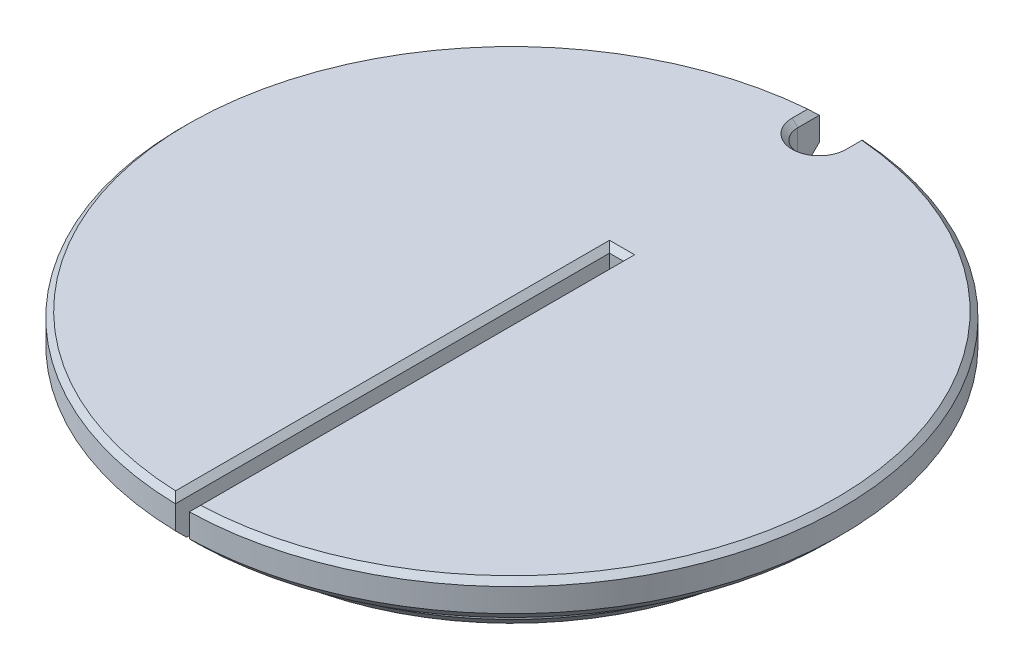
ISO-10303-21;
HEADER;
FILE_DESCRIPTION(('STEP AP214'),'2;1');
FILE_NAME('part.step','',(''),(''),'','','');
FILE_SCHEMA(('AUTOMOTIVE_DESIGN { 1 0 10303 214 1 1 1 1 }'));
ENDSEC;
DATA;
#1=APPLICATION_CONTEXT('core data for automotive mechanical design processes');
#2=APPLICATION_PROTOCOL_DEFINITION('international standard','automotive_design',2000,#1);
#3=PRODUCT_CONTEXT('',#1,'mechanical');
#4=PRODUCT('Part','Part','',(#3));
#5=PRODUCT_RELATED_PRODUCT_CATEGORY('part','',(#4));
#6=PRODUCT_DEFINITION_FORMATION('','',#4);
#7=PRODUCT_DEFINITION_CONTEXT('part definition',#1,'design');
#8=PRODUCT_DEFINITION('design','',#6,#7);
#9=PRODUCT_DEFINITION_SHAPE('','',#8);
#10=(LENGTH_UNIT() NAMED_UNIT(*) SI_UNIT(.MILLI.,.METRE.));
#11=(NAMED_UNIT(*) PLANE_ANGLE_UNIT() SI_UNIT($,.RADIAN.));
#12=(NAMED_UNIT(*) SI_UNIT($,.STERADIAN.) SOLID_ANGLE_UNIT());
#13=UNCERTAINTY_MEASURE_WITH_UNIT(LENGTH_MEASURE(1.E-05),#10,'distance_accuracy_value','');
#14=(GEOMETRIC_REPRESENTATION_CONTEXT(3) GLOBAL_UNCERTAINTY_ASSIGNED_CONTEXT((#13)) GLOBAL_UNIT_ASSIGNED_CONTEXT((#10,
#11,#12)) REPRESENTATION_CONTEXT('',''));
#15=CARTESIAN_POINT('',(0.,0.,0.));
#16=DIRECTION('',(0.,0.,1.));
#17=DIRECTION('',(1.,0.,0.));
#18=AXIS2_PLACEMENT_3D('',#15,#16,#17);
#19=CARTESIAN_POINT('',(3.49148133884313E-12,-1000.,0.));
#20=DIRECTION('',(0.,-1.,0.));
#21=DIRECTION('',(1.,0.,0.));
#22=AXIS2_PLACEMENT_3D('',#19,#20,#21);
#23=CYLINDRICAL_SURFACE('',#22,30.0228);
#24=DIRECTION('',(0.,-1.,0.));
#25=VECTOR('',#24,1.);
#26=CARTESIAN_POINT('',(1.95580000000349,-1000.,-29.9590281250911));
#27=LINE('',#26,#25);
#28=CARTESIAN_POINT('',(1.9558,-0.507999999999953,-29.9590281250911));
#29=VERTEX_POINT('',#28);
#30=CARTESIAN_POINT('',(1.95580000000001,-2.64160000000013,-29.9590281250911));
#31=VERTEX_POINT('',#30);
#32=EDGE_CURVE('E171',#29,#31,#27,.T.);
#33=ORIENTED_EDGE('',*,*,#32,.F.);
#34=CARTESIAN_POINT('',(0.,-0.507999999999842,0.));
#35=DIRECTION('',(0.,1.,0.));
#36=DIRECTION('',(-1.,0.,0.));
#37=AXIS2_PLACEMENT_3D('',#34,#35,#36);
#38=CIRCLE('',#37,30.0228);
#39=CARTESIAN_POINT('',(0.634999999999997,-0.507999999999842,30.0160839357835));
#40=VERTEX_POINT('',#39);
#41=EDGE_CURVE('E307',#29,#40,#38,.F.);
#42=ORIENTED_EDGE('',*,*,#41,.T.);
#43=DIRECTION('',(0.,-1.,0.));
#44=VECTOR('',#43,1.);
#45=CARTESIAN_POINT('',(0.635000000003487,-1000.,30.0160839357835));
#46=LINE('',#45,#44);
#47=CARTESIAN_POINT('',(0.635000000000004,-2.64160000000013,30.0160839357835));
#48=VERTEX_POINT('',#47);
#49=EDGE_CURVE('E216',#48,#40,#46,.F.);
#50=ORIENTED_EDGE('',*,*,#49,.F.);
#51=CARTESIAN_POINT('',(0.,-2.64160000000013,0.));
#52=DIRECTION('',(0.,-1.,0.));
#53=DIRECTION('',(1.,0.,0.));
#54=AXIS2_PLACEMENT_3D('',#51,#52,#53);
#55=CIRCLE('',#54,30.0228);
#56=EDGE_CURVE('E304',#48,#31,#55,.F.);
#57=ORIENTED_EDGE('',*,*,#56,.T.);
#58=EDGE_LOOP('',(#33,#42,#50,#57));
#59=FACE_BOUND('',#58,.T.);
#60=ADVANCED_FACE('F34',(#59),#23,.T.);
#61=CARTESIAN_POINT('',(30.0228,0.,0.));
#62=DIRECTION('',(0.,1.,0.));
#63=DIRECTION('',(-1.,0.,0.));
#64=AXIS2_PLACEMENT_3D('',#61,#62,#63);
#65=PLANE('',#64);
#66=CARTESIAN_POINT('',(0.,0.,0.));
#67=DIRECTION('',(0.,1.,0.));
#68=DIRECTION('',(-1.,0.,0.));
#69=AXIS2_PLACEMENT_3D('',#66,#67,#68);
#70=CIRCLE('',#69,29.5148000000001);
#71=CARTESIAN_POINT('',(1.14299999999981,0.,29.4926595959064));
#72=VERTEX_POINT('',#71);
#73=CARTESIAN_POINT('',(2.46379999999981,0.,-29.4117851991342));
#74=VERTEX_POINT('',#73);
#75=EDGE_CURVE('E425',#72,#74,#70,.T.);
#76=ORIENTED_EDGE('',*,*,#75,.T.);
#77=DIRECTION('',(0.,0.,1.));
#78=VECTOR('',#77,1.);
#79=CARTESIAN_POINT('',(2.46379999999981,0.,-27.9908));
#80=LINE('',#79,#78);
#81=CARTESIAN_POINT('',(2.46379999999981,0.,-27.9908));
#82=VERTEX_POINT('',#81);
#83=EDGE_CURVE('E370',#74,#82,#80,.T.);
#84=ORIENTED_EDGE('',*,*,#83,.T.);
#85=CARTESIAN_POINT('',(0.,0.,-27.9908));
#86=DIRECTION('',(0.,1.,0.));
#87=DIRECTION('',(-1.,0.,0.));
#88=AXIS2_PLACEMENT_3D('',#85,#86,#87);
#89=CIRCLE('',#88,2.46379999999981);
#90=CARTESIAN_POINT('',(-2.46379999999981,0.,-27.9908));
#91=VERTEX_POINT('',#90);
#92=EDGE_CURVE('E432',#82,#91,#89,.F.);
#93=ORIENTED_EDGE('',*,*,#92,.T.);
#94=DIRECTION('',(0.,0.,-1.));
#95=VECTOR('',#94,1.);
#96=CARTESIAN_POINT('',(-2.46379999999981,0.,-29.9590281250911));
#97=LINE('',#96,#95);
#98=CARTESIAN_POINT('',(-2.46379999999981,0.,-29.4117851991342));
#99=VERTEX_POINT('',#98);
#100=EDGE_CURVE('E430',#91,#99,#97,.T.);
#101=ORIENTED_EDGE('',*,*,#100,.T.);
#102=CARTESIAN_POINT('',(0.,0.,0.));
#103=DIRECTION('',(0.,1.,0.));
#104=DIRECTION('',(-1.,0.,0.));
#105=AXIS2_PLACEMENT_3D('',#102,#103,#104);
#106=CIRCLE('',#105,29.5148000000001);
#107=CARTESIAN_POINT('',(-1.14299999999981,0.,29.4926595959064));
#108=VERTEX_POINT('',#107);
#109=EDGE_CURVE('E357',#99,#108,#106,.T.);
#110=ORIENTED_EDGE('',*,*,#109,.T.);
#111=DIRECTION('',(0.,0.,-1.));
#112=VECTOR('',#111,1.);
#113=CARTESIAN_POINT('',(-1.14299999999982,0.,-9.52500000000001));
#114=LINE('',#113,#112);
#115=CARTESIAN_POINT('',(-1.14299999999982,0.,-10.0329999999998));
#116=VERTEX_POINT('',#115);
#117=EDGE_CURVE('E349',#108,#116,#114,.T.);
#118=ORIENTED_EDGE('',*,*,#117,.T.);
#119=DIRECTION('',(1.,0.,0.));
#120=VECTOR('',#119,1.);
#121=CARTESIAN_POINT('',(0.635,0.,-10.0329999999998));
#122=LINE('',#121,#120);
#123=CARTESIAN_POINT('',(1.14299999999981,0.,-10.0329999999998));
#124=VERTEX_POINT('',#123);
#125=EDGE_CURVE('E421',#116,#124,#122,.T.);
#126=ORIENTED_EDGE('',*,*,#125,.T.);
#127=DIRECTION('',(0.,0.,1.));
#128=VECTOR('',#127,1.);
#129=CARTESIAN_POINT('',(1.14299999999981,0.,30.0160839357835));
#130=LINE('',#129,#128);
#131=EDGE_CURVE('E423',#124,#72,#130,.T.);
#132=ORIENTED_EDGE('',*,*,#131,.T.);
#133=EDGE_LOOP('',(#76,#84,#93,#101,#110,#118,#126,#132));
#134=FACE_BOUND('',#133,.T.);
#135=ADVANCED_FACE('F323',(#134),#65,.T.);
#136=CARTESIAN_POINT('',(0.,-7.62000000000004,0.));
#137=DIRECTION('',(0.,-1.,0.));
#138=DIRECTION('',(1.,0.,0.));
#139=AXIS2_PLACEMENT_3D('',#136,#137,#138);
#140=PLANE('',#139);
#141=DIRECTION('',(0.,0.,1.));
#142=VECTOR('',#141,1.);
#143=CARTESIAN_POINT('',(-0.634999999999973,-7.62000000000011,-9.52500000000001));
#144=LINE('',#143,#142);
#145=CARTESIAN_POINT('',(-0.634999999999973,-7.62000000000011,-9.52500000000001));
#146=VERTEX_POINT('',#145);
#147=CARTESIAN_POINT('',(-0.634999999999969,-7.62000000000011,24.0454168073668));
#148=VERTEX_POINT('',#147);
#149=EDGE_CURVE('E188',#146,#148,#144,.T.);
#150=ORIENTED_EDGE('',*,*,#149,.T.);
#151=CARTESIAN_POINT('',(0.,-7.62000000000004,0.));
#152=DIRECTION('',(0.,-1.,0.));
#153=DIRECTION('',(1.,0.,0.));
#154=AXIS2_PLACEMENT_3D('',#151,#152,#153);
#155=CIRCLE('',#154,24.0538);
#156=CARTESIAN_POINT('',(0.635000000000022,-7.6200000000001,24.0454168073668));
#157=VERTEX_POINT('',#156);
#158=EDGE_CURVE('E290',#148,#157,#155,.T.);
#159=ORIENTED_EDGE('',*,*,#158,.T.);
#160=DIRECTION('',(0.,0.,-1.));
#161=VECTOR('',#160,1.);
#162=CARTESIAN_POINT('',(0.635000000000027,-7.6200000000001,-9.52500000000001));
#163=LINE('',#162,#161);
#164=CARTESIAN_POINT('',(0.635000000000027,-7.6200000000001,-9.52500000000001));
#165=VERTEX_POINT('',#164);
#166=EDGE_CURVE('E194',#157,#165,#163,.T.);
#167=ORIENTED_EDGE('',*,*,#166,.T.);
#168=DIRECTION('',(-1.,0.,0.));
#169=VECTOR('',#168,1.);
#170=CARTESIAN_POINT('',(-0.634999999999973,-7.62000000000011,-9.52500000000001));
#171=LINE('',#170,#169);
#172=EDGE_CURVE('E196',#165,#146,#171,.T.);
#173=ORIENTED_EDGE('',*,*,#172,.T.);
#174=EDGE_LOOP('',(#150,#159,#167,#173));
#175=FACE_BOUND('',#174,.T.);
#176=ADVANCED_FACE('F328',(#175),#140,.T.);
#177=CARTESIAN_POINT('',(3.49148133884313E-12,-1000.,0.));
#178=DIRECTION('',(0.,-1.,0.));
#179=DIRECTION('',(1.,0.,0.));
#180=AXIS2_PLACEMENT_3D('',#177,#178,#179);
#181=CYLINDRICAL_SURFACE('',#180,25.0698);
#182=DIRECTION('',(0.,-1.,0.));
#183=VECTOR('',#182,1.);
#184=CARTESIAN_POINT('',(0.635000000003487,-1000.,25.0617566630913));
#185=LINE('',#184,#183);
#186=CARTESIAN_POINT('',(0.635000000000019,-6.60400000000005,25.0617566630913));
#187=VERTEX_POINT('',#186);
#188=CARTESIAN_POINT('',(0.635000000000011,-3.65760000000015,25.0617566630913));
#189=VERTEX_POINT('',#188);
#190=EDGE_CURVE('E206',#187,#189,#185,.F.);
#191=ORIENTED_EDGE('',*,*,#190,.F.);
#192=CARTESIAN_POINT('',(0.,-6.60400000000005,0.));
#193=DIRECTION('',(0.,-1.,0.));
#194=DIRECTION('',(1.,0.,0.));
#195=AXIS2_PLACEMENT_3D('',#192,#193,#194);
#196=CIRCLE('',#195,25.0698);
#197=CARTESIAN_POINT('',(-0.634999999999973,-6.60400000000006,25.0617566630913));
#198=VERTEX_POINT('',#197);
#199=EDGE_CURVE('E271',#187,#198,#196,.F.);
#200=ORIENTED_EDGE('',*,*,#199,.T.);
#201=DIRECTION('',(0.,-1.,0.));
#202=VECTOR('',#201,1.);
#203=CARTESIAN_POINT('',(-0.634999999996504,-1000.,25.0617566630913));
#204=LINE('',#203,#202);
#205=CARTESIAN_POINT('',(-0.634999999999983,-3.65760000000015,25.0617566630913));
#206=VERTEX_POINT('',#205);
#207=EDGE_CURVE('E210',#206,#198,#204,.T.);
#208=ORIENTED_EDGE('',*,*,#207,.F.);
#209=CARTESIAN_POINT('',(0.,-3.65760000000015,0.));
#210=DIRECTION('',(0.,-1.,0.));
#211=DIRECTION('',(1.,0.,0.));
#212=AXIS2_PLACEMENT_3D('',#209,#210,#211);
#213=CIRCLE('',#212,25.0698);
#214=EDGE_CURVE('E213',#206,#189,#213,.T.);
#215=ORIENTED_EDGE('',*,*,#214,.T.);
#216=EDGE_LOOP('',(#191,#200,#208,#215));
#217=FACE_BOUND('',#216,.T.);
#218=ADVANCED_FACE('F337',(#217),#181,.T.);
#219=CARTESIAN_POINT('',(25.0698,-3.65760000000001,0.));
#220=DIRECTION('',(0.,-1.,0.));
#221=DIRECTION('',(1.,0.,0.));
#222=AXIS2_PLACEMENT_3D('',#219,#220,#221);
#223=PLANE('',#222);
#224=DIRECTION('',(0.,0.,-1.));
#225=VECTOR('',#224,1.);
#226=CARTESIAN_POINT('',(-0.634999999999986,-3.6576000000001,0.));
#227=LINE('',#226,#225);
#228=CARTESIAN_POINT('',(-0.634999999999983,-3.6576000000001,28.9998486416742));
#229=VERTEX_POINT('',#228);
#230=EDGE_CURVE('E208',#229,#206,#227,.T.);
#231=ORIENTED_EDGE('',*,*,#230,.F.);
#232=CARTESIAN_POINT('',(0.,-3.6576000000001,0.));
#233=DIRECTION('',(0.,-1.,0.));
#234=DIRECTION('',(1.,0.,0.));
#235=AXIS2_PLACEMENT_3D('',#232,#233,#234);
#236=CIRCLE('',#235,29.0068000000002);
#237=CARTESIAN_POINT('',(-1.95579999999999,-3.6576000000001,-28.9407894259989));
#238=VERTEX_POINT('',#237);
#239=EDGE_CURVE('E185',#229,#238,#236,.T.);
#240=ORIENTED_EDGE('',*,*,#239,.T.);
#241=DIRECTION('',(0.,0.,-1.));
#242=VECTOR('',#241,1.);
#243=CARTESIAN_POINT('',(-1.95579999999999,-3.6576000000001,0.));
#244=LINE('',#243,#242);
#245=CARTESIAN_POINT('',(-1.95579999999999,-3.6576000000001,-27.9908));
#246=VERTEX_POINT('',#245);
#247=EDGE_CURVE('E177',#246,#238,#244,.T.);
#248=ORIENTED_EDGE('',*,*,#247,.F.);
#249=CARTESIAN_POINT('',(0.,-3.6576000000001,-27.9908));
#250=DIRECTION('',(0.,-1.,0.));
#251=DIRECTION('',(1.,0.,0.));
#252=AXIS2_PLACEMENT_3D('',#249,#250,#251);
#253=CIRCLE('',#252,1.9558);
#254=CARTESIAN_POINT('',(1.95580000000001,-3.65760000000009,-27.9908));
#255=VERTEX_POINT('',#254);
#256=EDGE_CURVE('E160',#255,#246,#253,.T.);
#257=ORIENTED_EDGE('',*,*,#256,.F.);
#258=DIRECTION('',(0.,0.,1.));
#259=VECTOR('',#258,1.);
#260=CARTESIAN_POINT('',(1.95580000000001,-3.65760000000009,0.));
#261=LINE('',#260,#259);
#262=CARTESIAN_POINT('',(1.95580000000001,-3.65760000000009,-28.9407894259988));
#263=VERTEX_POINT('',#262);
#264=EDGE_CURVE('E186',#263,#255,#261,.T.);
#265=ORIENTED_EDGE('',*,*,#264,.F.);
#266=CARTESIAN_POINT('',(0.,-3.6576000000001,0.));
#267=DIRECTION('',(0.,-1.,0.));
#268=DIRECTION('',(1.,0.,0.));
#269=AXIS2_PLACEMENT_3D('',#266,#267,#268);
#270=CIRCLE('',#269,29.0068);
#271=CARTESIAN_POINT('',(0.63500000000001,-3.65760000000009,28.999848641674));
#272=VERTEX_POINT('',#271);
#273=EDGE_CURVE('E170',#263,#272,#270,.T.);
#274=ORIENTED_EDGE('',*,*,#273,.T.);
#275=DIRECTION('',(0.,0.,1.));
#276=VECTOR('',#275,1.);
#277=CARTESIAN_POINT('',(0.635000000000014,-3.65760000000009,0.));
#278=LINE('',#277,#276);
#279=EDGE_CURVE('E202',#189,#272,#278,.T.);
#280=ORIENTED_EDGE('',*,*,#279,.F.);
#281=ORIENTED_EDGE('',*,*,#214,.F.);
#282=EDGE_LOOP('',(#231,#240,#248,#257,#265,#274,#280,#281));
#283=FACE_BOUND('',#282,.T.);
#284=ADVANCED_FACE('F183',(#283),#223,.T.);
#285=DIRECTION('',(0.,-1.,0.));
#286=VECTOR('',#285,1.);
#287=CARTESIAN_POINT('',(-0.634999999996504,-1000.,30.0160839357835));
#288=LINE('',#287,#286);
#289=CARTESIAN_POINT('',(-0.634999999999993,-0.507999999999953,30.0160839357835));
#290=VERTEX_POINT('',#289);
#291=CARTESIAN_POINT('',(-0.634999999999986,-2.64160000000025,30.0160839357835));
#292=VERTEX_POINT('',#291);
#293=EDGE_CURVE('E219',#290,#292,#288,.T.);
#294=ORIENTED_EDGE('',*,*,#293,.F.);
#295=CARTESIAN_POINT('',(0.,-0.507999999999842,0.));
#296=DIRECTION('',(0.,1.,0.));
#297=DIRECTION('',(-1.,0.,0.));
#298=AXIS2_PLACEMENT_3D('',#295,#296,#297);
#299=CIRCLE('',#298,30.0228);
#300=CARTESIAN_POINT('',(-1.9558,-0.507999999999953,-29.9590281250911));
#301=VERTEX_POINT('',#300);
#302=EDGE_CURVE('E11',#290,#301,#299,.F.);
#303=ORIENTED_EDGE('',*,*,#302,.T.);
#304=DIRECTION('',(0.,-1.,0.));
#305=VECTOR('',#304,1.);
#306=CARTESIAN_POINT('',(-1.95579999999651,-1000.,-29.9590281250911));
#307=LINE('',#306,#305);
#308=CARTESIAN_POINT('',(-1.95579999999999,-2.64160000000024,-29.9590281250911));
#309=VERTEX_POINT('',#308);
#310=EDGE_CURVE('E221',#309,#301,#307,.F.);
#311=ORIENTED_EDGE('',*,*,#310,.F.);
#312=CARTESIAN_POINT('',(0.,-2.64160000000024,0.));
#313=DIRECTION('',(0.,-1.,0.));
#314=DIRECTION('',(1.,0.,0.));
#315=AXIS2_PLACEMENT_3D('',#312,#313,#314);
#316=CIRCLE('',#315,30.0228);
#317=EDGE_CURVE('E234',#309,#292,#316,.F.);
#318=ORIENTED_EDGE('',*,*,#317,.T.);
#319=EDGE_LOOP('',(#294,#303,#311,#318));
#320=FACE_BOUND('',#319,.T.);
#321=ADVANCED_FACE('F324',(#320),#23,.T.);
#322=CARTESIAN_POINT('',(-0.634999999999973,-7.62000000000011,-9.52500000000001));
#323=DIRECTION('',(-1.,0.,0.));
#324=DIRECTION('',(0.,-1.,0.));
#325=AXIS2_PLACEMENT_3D('',#322,#323,#324);
#326=PLANE('',#325);
#327=DIRECTION('',(0.,1.,0.));
#328=VECTOR('',#327,1.);
#329=CARTESIAN_POINT('',(-0.634999999999973,-7.62000000000011,-9.52500000000001));
#330=LINE('',#329,#328);
#331=CARTESIAN_POINT('',(-0.634999999999998,-0.507999999999857,-9.52500000000001));
#332=VERTEX_POINT('',#331);
#333=EDGE_CURVE('E200',#146,#332,#330,.T.);
#334=ORIENTED_EDGE('',*,*,#333,.T.);
#335=DIRECTION('',(0.,0.,1.));
#336=VECTOR('',#335,1.);
#337=CARTESIAN_POINT('',(-0.634999999999993,-0.507999999999856,30.0160839357835));
#338=LINE('',#337,#336);
#339=EDGE_CURVE('E48',#332,#290,#338,.T.);
#340=ORIENTED_EDGE('',*,*,#339,.T.);
#341=ORIENTED_EDGE('',*,*,#293,.T.);
#342=CARTESIAN_POINT('',(-0.634999999999986,-2.64160000000025,30.0160839357835));
#343=CARTESIAN_POINT('',(-0.634999999999985,-2.81093400853678,29.8467120618122));
#344=CARTESIAN_POINT('',(-0.634999999999985,-2.98026767947169,29.6773398503174));
#345=CARTESIAN_POINT('',(-0.634999999999984,-3.31893434613831,29.338594752281));
#346=CARTESIAN_POINT('',(-0.634999999999983,-3.48826734187001,29.1692218657393));
#347=CARTESIAN_POINT('',(-0.634999999999983,-3.6576000000001,28.9998486416742));
#348=B_SPLINE_CURVE_WITH_KNOTS('',3,(#342,#343,#344,#345,#346,#347),.UNSPECIFIED.,.F.,.F.,(4,2,
4),(0.,0.71850368353285,1.4370073670658),.UNSPECIFIED.);
#349=EDGE_CURVE('E286',#292,#229,#348,.T.);
#350=ORIENTED_EDGE('',*,*,#349,.T.);
#351=ORIENTED_EDGE('',*,*,#230,.T.);
#352=ORIENTED_EDGE('',*,*,#207,.T.);
#353=CARTESIAN_POINT('',(-0.634999999999973,-6.60400000000006,25.0617566630913));
#354=CARTESIAN_POINT('',(-0.634999999999972,-6.77333450543348,24.8923678588454));
#355=CARTESIAN_POINT('',(-0.634999999999972,-6.94266842481684,24.7229784687455));
#356=CARTESIAN_POINT('',(-0.634999999999971,-7.2813350914835,24.3841985168374));
#357=CARTESIAN_POINT('',(-0.63499999999997,-7.45066783876681,24.2148079550292));
#358=CARTESIAN_POINT('',(-0.634999999999969,-7.62000000000005,24.0454168073668));
#359=B_SPLINE_CURVE_WITH_KNOTS('',3,(#353,#354,#355,#356,#357,#358),.UNSPECIFIED.,.F.,.F.,(4,2,
4),(0.,0.718540656879898,1.43708131376016),.UNSPECIFIED.);
#360=EDGE_CURVE('E281',#198,#148,#359,.T.);
#361=ORIENTED_EDGE('',*,*,#360,.T.);
#362=ORIENTED_EDGE('',*,*,#149,.F.);
#363=EDGE_LOOP('',(#334,#340,#341,#350,#351,#352,#361,#362));
#364=FACE_BOUND('',#363,.T.);
#365=ADVANCED_FACE('F249',(#364),#326,.F.);
#366=CARTESIAN_POINT('',(-0.634999999999973,-7.62000000000011,-9.52500000000001));
#367=DIRECTION('',(0.,0.,-1.));
#368=DIRECTION('',(-1.,0.,0.));
#369=AXIS2_PLACEMENT_3D('',#366,#367,#368);
#370=PLANE('',#369);
#371=DIRECTION('',(0.,1.,0.));
#372=VECTOR('',#371,1.);
#373=CARTESIAN_POINT('',(0.635000000000027,-7.6200000000001,-9.52500000000001));
#374=LINE('',#373,#372);
#375=CARTESIAN_POINT('',(0.635000000000002,-0.507999999999851,-9.52500000000001));
#376=VERTEX_POINT('',#375);
#377=EDGE_CURVE('E199',#165,#376,#374,.T.);
#378=ORIENTED_EDGE('',*,*,#377,.T.);
#379=DIRECTION('',(-1.,0.,0.));
#380=VECTOR('',#379,1.);
#381=CARTESIAN_POINT('',(-0.634999999999998,-0.507999999999856,-9.52500000000001));
#382=LINE('',#381,#380);
#383=EDGE_CURVE('E63',#376,#332,#382,.T.);
#384=ORIENTED_EDGE('',*,*,#383,.T.);
#385=ORIENTED_EDGE('',*,*,#333,.F.);
#386=ORIENTED_EDGE('',*,*,#172,.F.);
#387=EDGE_LOOP('',(#378,#384,#385,#386));
#388=FACE_BOUND('',#387,.T.);
#389=ADVANCED_FACE('F245',(#388),#370,.F.);
#390=CARTESIAN_POINT('',(0.635000000000027,-7.6200000000001,-9.52500000000001));
#391=DIRECTION('',(1.,0.,0.));
#392=DIRECTION('',(0.,1.,0.));
#393=AXIS2_PLACEMENT_3D('',#390,#391,#392);
#394=PLANE('',#393);
#395=ORIENTED_EDGE('',*,*,#49,.T.);
#396=DIRECTION('',(0.,0.,-1.));
#397=VECTOR('',#396,1.);
#398=CARTESIAN_POINT('',(0.635000000000002,-0.507999999999851,-9.52500000000001));
#399=LINE('',#398,#397);
#400=EDGE_CURVE('E368',#40,#376,#399,.T.);
#401=ORIENTED_EDGE('',*,*,#400,.T.);
#402=ORIENTED_EDGE('',*,*,#377,.F.);
#403=ORIENTED_EDGE('',*,*,#166,.F.);
#404=CARTESIAN_POINT('',(0.635000000000022,-7.62000000000004,24.0454168073668));
#405=CARTESIAN_POINT('',(0.635000000000022,-7.4506678387668,24.2148079550292));
#406=CARTESIAN_POINT('',(0.635000000000021,-7.2813350914835,24.3841985168374));
#407=CARTESIAN_POINT('',(0.63500000000002,-6.94266842481683,24.7229784687455));
#408=CARTESIAN_POINT('',(0.635000000000019,-6.77333450543348,24.8923678588454));
#409=CARTESIAN_POINT('',(0.635000000000019,-6.60400000000005,25.0617566630913));
#410=B_SPLINE_CURVE_WITH_KNOTS('',3,(#404,#405,#406,#407,#408,#409),.UNSPECIFIED.,.F.,.F.,(4,2,
4),(0.,0.718540656880257,1.43708131376016),.UNSPECIFIED.);
#411=EDGE_CURVE('E266',#157,#187,#410,.T.);
#412=ORIENTED_EDGE('',*,*,#411,.T.);
#413=ORIENTED_EDGE('',*,*,#190,.T.);
#414=ORIENTED_EDGE('',*,*,#279,.T.);
#415=CARTESIAN_POINT('',(0.63500000000001,-3.65760000000009,28.999848641674));
#416=CARTESIAN_POINT('',(0.635000000000009,-3.48826734186999,29.1692218657392));
#417=CARTESIAN_POINT('',(0.635000000000007,-3.31893434613826,29.3385947522809));
#418=CARTESIAN_POINT('',(0.635000000000005,-2.98026767947161,29.6773398503174));
#419=CARTESIAN_POINT('',(0.635000000000005,-2.81093400853668,29.8467120618121));
#420=CARTESIAN_POINT('',(0.635000000000004,-2.64160000000013,30.0160839357835));
#421=B_SPLINE_CURVE_WITH_KNOTS('',3,(#415,#416,#417,#418,#419,#420),.UNSPECIFIED.,.F.,.F.,(4,2,
4),(0.,0.718503683533045,1.43700736706599),.UNSPECIFIED.);
#422=EDGE_CURVE('E259',#272,#48,#421,.T.);
#423=ORIENTED_EDGE('',*,*,#422,.T.);
#424=EDGE_LOOP('',(#395,#401,#402,#403,#412,#413,#414,#423));
#425=FACE_BOUND('',#424,.T.);
#426=ADVANCED_FACE('F248',(#425),#394,.F.);
#427=CARTESIAN_POINT('',(1.95580000000003,-7.6200000000002,-29.9590281250911));
#428=DIRECTION('',(1.,0.,0.));
#429=DIRECTION('',(0.,1.,0.));
#430=AXIS2_PLACEMENT_3D('',#427,#428,#429);
#431=PLANE('',#430);
#432=DIRECTION('',(0.,1.,0.));
#433=VECTOR('',#432,1.);
#434=CARTESIAN_POINT('',(1.95580000000003,-7.6200000000002,-27.9908));
#435=LINE('',#434,#433);
#436=CARTESIAN_POINT('',(1.9558,-0.507999999999847,-27.9908));
#437=VERTEX_POINT('',#436);
#438=EDGE_CURVE('E166',#255,#437,#435,.T.);
#439=ORIENTED_EDGE('',*,*,#438,.T.);
#440=DIRECTION('',(0.,0.,-1.));
#441=VECTOR('',#440,1.);
#442=CARTESIAN_POINT('',(1.9558,-0.507999999999847,-29.9590281250911));
#443=LINE('',#442,#441);
#444=EDGE_CURVE('E309',#437,#29,#443,.T.);
#445=ORIENTED_EDGE('',*,*,#444,.T.);
#446=ORIENTED_EDGE('',*,*,#32,.T.);
#447=CARTESIAN_POINT('',(1.95580000000001,-2.64160000000013,-29.9590281250911));
#448=CARTESIAN_POINT('',(1.95580000000001,-2.81093977652908,-29.7893281042741));
#449=CARTESIAN_POINT('',(1.95580000000001,-2.98027633145969,-29.6196248689418));
#450=CARTESIAN_POINT('',(1.95580000000001,-3.31894299812634,-29.2802119692443));
#451=CARTESIAN_POINT('',(1.95580000000001,-3.48827310986239,-29.1105023048792));
#452=CARTESIAN_POINT('',(1.95580000000001,-3.65760000000009,-28.9407894259988));
#453=B_SPLINE_CURVE_WITH_KNOTS('',3,(#447,#448,#449,#450,#451,#452),.UNSPECIFIED.,.F.,.F.,(4,2,
4),(0.,0.719212424991594,1.43842484999211),.UNSPECIFIED.);
#454=EDGE_CURVE('E308',#31,#263,#453,.T.);
#455=ORIENTED_EDGE('',*,*,#454,.T.);
#456=ORIENTED_EDGE('',*,*,#264,.T.);
#457=EDGE_LOOP('',(#439,#445,#446,#455,#456));
#458=FACE_BOUND('',#457,.T.);
#459=ADVANCED_FACE('F253',(#458),#431,.F.);
#460=CARTESIAN_POINT('',(0.,-7.62000000000021,-27.9908));
#461=DIRECTION('',(0.,1.,0.));
#462=DIRECTION('',(-1.,0.,0.));
#463=AXIS2_PLACEMENT_3D('',#460,#461,#462);
#464=CYLINDRICAL_SURFACE('',#463,1.9558);
#465=DIRECTION('',(0.,1.,0.));
#466=VECTOR('',#465,1.);
#467=CARTESIAN_POINT('',(-1.95579999999997,-7.62000000000022,-27.9908));
#468=LINE('',#467,#466);
#469=CARTESIAN_POINT('',(-1.9558,-0.507999999999861,-27.9908));
#470=VERTEX_POINT('',#469);
#471=EDGE_CURVE('E163',#246,#470,#468,.T.);
#472=ORIENTED_EDGE('',*,*,#471,.T.);
#473=CARTESIAN_POINT('',(0.,-0.507999999999854,-27.9908));
#474=DIRECTION('',(0.,1.,0.));
#475=DIRECTION('',(-1.,0.,0.));
#476=AXIS2_PLACEMENT_3D('',#473,#474,#475);
#477=CIRCLE('',#476,1.9558);
#478=EDGE_CURVE('E366',#470,#437,#477,.T.);
#479=ORIENTED_EDGE('',*,*,#478,.T.);
#480=ORIENTED_EDGE('',*,*,#438,.F.);
#481=ORIENTED_EDGE('',*,*,#256,.T.);
#482=EDGE_LOOP('',(#472,#479,#480,#481));
#483=FACE_BOUND('',#482,.T.);
#484=ADVANCED_FACE('F162',(#483),#464,.F.);
#485=CARTESIAN_POINT('',(-1.95579999999997,-7.62000000000022,-29.9590281250911));
#486=DIRECTION('',(-1.,0.,0.));
#487=DIRECTION('',(0.,-1.,0.));
#488=AXIS2_PLACEMENT_3D('',#485,#486,#487);
#489=PLANE('',#488);
#490=ORIENTED_EDGE('',*,*,#310,.T.);
#491=DIRECTION('',(0.,0.,1.));
#492=VECTOR('',#491,1.);
#493=CARTESIAN_POINT('',(-1.9558,-0.507999999999861,-27.9908));
#494=LINE('',#493,#492);
#495=EDGE_CURVE('E179',#301,#470,#494,.T.);
#496=ORIENTED_EDGE('',*,*,#495,.T.);
#497=ORIENTED_EDGE('',*,*,#471,.F.);
#498=ORIENTED_EDGE('',*,*,#247,.T.);
#499=CARTESIAN_POINT('',(-1.95579999999999,-3.6576000000001,-28.9407894259989));
#500=CARTESIAN_POINT('',(-1.95579999999999,-3.48827310986242,-29.1105023048793));
#501=CARTESIAN_POINT('',(-1.95579999999999,-3.31894299812639,-29.2802119692444));
#502=CARTESIAN_POINT('',(-1.95579999999999,-2.98027633145978,-29.6196248689418));
#503=CARTESIAN_POINT('',(-1.95579999999999,-2.81093977652918,-29.7893281042741));
#504=CARTESIAN_POINT('',(-1.95579999999999,-2.64160000000025,-29.9590281250911));
#505=B_SPLINE_CURVE_WITH_KNOTS('',3,(#499,#500,#501,#502,#503,#504),.UNSPECIFIED.,.F.,.F.,(4,2,
4),(0.,0.71921242500042,1.43842484999192),.UNSPECIFIED.);
#506=EDGE_CURVE('E227',#238,#309,#505,.T.);
#507=ORIENTED_EDGE('',*,*,#506,.T.);
#508=EDGE_LOOP('',(#490,#496,#497,#498,#507));
#509=FACE_BOUND('',#508,.T.);
#510=ADVANCED_FACE('F176',(#509),#489,.F.);
#511=CARTESIAN_POINT('',(0.,-3.65760000000015,0.));
#512=DIRECTION('',(0.,1.,0.));
#513=DIRECTION('',(-1.,0.,0.));
#514=AXIS2_PLACEMENT_3D('',#511,#512,#513);
#515=CONICAL_SURFACE('',#514,29.0068000000001,0.785398163397428);
#516=ORIENTED_EDGE('',*,*,#349,.F.);
#517=ORIENTED_EDGE('',*,*,#317,.F.);
#518=ORIENTED_EDGE('',*,*,#506,.F.);
#519=ORIENTED_EDGE('',*,*,#239,.F.);
#520=EDGE_LOOP('',(#516,#517,#518,#519));
#521=FACE_BOUND('',#520,.T.);
#522=ADVANCED_FACE('F236',(#521),#515,.T.);
#523=CARTESIAN_POINT('',(0.,-7.62000000000007,0.));
#524=DIRECTION('',(0.,1.,0.));
#525=DIRECTION('',(-1.,0.,0.));
#526=AXIS2_PLACEMENT_3D('',#523,#524,#525);
#527=CONICAL_SURFACE('',#526,24.0538,0.785398163397443);
#528=ORIENTED_EDGE('',*,*,#360,.F.);
#529=ORIENTED_EDGE('',*,*,#199,.F.);
#530=ORIENTED_EDGE('',*,*,#411,.F.);
#531=ORIENTED_EDGE('',*,*,#158,.F.);
#532=EDGE_LOOP('',(#528,#529,#530,#531));
#533=FACE_BOUND('',#532,.T.);
#534=ADVANCED_FACE('F273',(#533),#527,.T.);
#535=CARTESIAN_POINT('',(0.,-3.65760000000015,0.));
#536=DIRECTION('',(0.,1.,0.));
#537=DIRECTION('',(-1.,0.,0.));
#538=AXIS2_PLACEMENT_3D('',#535,#536,#537);
#539=CONICAL_SURFACE('',#538,29.0068,0.78539816339745);
#540=ORIENTED_EDGE('',*,*,#454,.F.);
#541=ORIENTED_EDGE('',*,*,#56,.F.);
#542=ORIENTED_EDGE('',*,*,#422,.F.);
#543=ORIENTED_EDGE('',*,*,#273,.F.);
#544=EDGE_LOOP('',(#540,#541,#542,#543));
#545=FACE_BOUND('',#544,.T.);
#546=ADVANCED_FACE('F276',(#545),#539,.T.);
#547=CARTESIAN_POINT('',(-0.634999999999998,-0.507999999999856,-9.52500000000001));
#548=DIRECTION('',(0.707106781186535,0.70710678118656,0.));
#549=DIRECTION('',(0.,0.,-1.));
#550=AXIS2_PLACEMENT_3D('',#547,#548,#549);
#551=PLANE('',#550);
#552=DIRECTION('',(-0.577350269189634,0.577350269189614,-0.577350269189629));
#553=VECTOR('',#552,1.);
#554=CARTESIAN_POINT('',(-0.634999999999998,-0.507999999999856,-9.52500000000001));
#555=LINE('',#554,#553);
#556=EDGE_CURVE('E352',#116,#332,#555,.F.);
#557=ORIENTED_EDGE('',*,*,#556,.F.);
#558=ORIENTED_EDGE('',*,*,#117,.F.);
#559=CARTESIAN_POINT('',(-0.634999999999993,-0.507999999999897,30.0160839357835));
#560=CARTESIAN_POINT('',(-0.719924893795325,-0.423075106204548,29.9293477905216));
#561=CARTESIAN_POINT('',(-0.804720672448613,-0.338279327551249,29.8423610245409));
#562=CARTESIAN_POINT('',(-0.974054005801192,-0.168945994198663,29.6678862446193));
#563=CARTESIAN_POINT('',(-1.05859156048118,-0.0844084395186814,29.580398230641));
#564=CARTESIAN_POINT('',(-1.14299999999981,0.,29.4926595959064));
#565=B_SPLINE_CURVE_WITH_KNOTS('',3,(#559,#560,#561,#562,#563,#564),.UNSPECIFIED.,.F.,.F.,(4,2,
4),(0.,0.444439096497644,0.888878226223711),.UNSPECIFIED.);
#566=EDGE_CURVE('E39',#290,#108,#565,.T.);
#567=ORIENTED_EDGE('',*,*,#566,.F.);
#568=ORIENTED_EDGE('',*,*,#339,.F.);
#569=EDGE_LOOP('',(#557,#558,#567,#568));
#570=FACE_BOUND('',#569,.T.);
#571=ADVANCED_FACE('F36',(#570),#551,.T.);
#572=CARTESIAN_POINT('',(0.,-0.507999999999842,0.));
#573=DIRECTION('',(0.,-1.,0.));
#574=DIRECTION('',(1.,0.,0.));
#575=AXIS2_PLACEMENT_3D('',#572,#573,#574);
#576=CONICAL_SURFACE('',#575,30.0228,0.785398163397523);
#577=ORIENTED_EDGE('',*,*,#566,.T.);
#578=ORIENTED_EDGE('',*,*,#109,.F.);
#579=CARTESIAN_POINT('',(-2.46379999999981,0.,-29.4117851991342));
#580=CARTESIAN_POINT('',(-2.37941987787085,-0.0843801221290214,-29.5035243566364));
#581=CARTESIAN_POINT('',(-2.29489648168431,-0.168903518315558,-29.5949975144597));
#582=CARTESIAN_POINT('',(-2.1255631483269,-0.338236851672966,-29.7774118230673));
#583=CARTESIAN_POINT('',(-2.04075321118016,-0.423046788819705,-29.8683529738962));
#584=CARTESIAN_POINT('',(-1.95579999999997,-0.507999999999885,-29.9590281250911));
#585=B_SPLINE_CURVE_WITH_KNOTS('',3,(#579,#580,#581,#582,#583,#584),.UNSPECIFIED.,.F.,.F.,(4,2,
4),(0.,0.451554790110737,0.903109542190516),.UNSPECIFIED.);
#586=EDGE_CURVE('E356',#301,#99,#585,.F.);
#587=ORIENTED_EDGE('',*,*,#586,.F.);
#588=ORIENTED_EDGE('',*,*,#302,.F.);
#589=EDGE_LOOP('',(#577,#578,#587,#588));
#590=FACE_BOUND('',#589,.T.);
#591=ADVANCED_FACE('F354',(#590),#576,.T.);
#592=CARTESIAN_POINT('',(-0.634999999999998,-0.507999999999856,-9.52500000000001));
#593=DIRECTION('',(0.,0.707106781186555,0.70710678118654));
#594=DIRECTION('',(1.,0.,0.));
#595=AXIS2_PLACEMENT_3D('',#592,#593,#594);
#596=PLANE('',#595);
#597=ORIENTED_EDGE('',*,*,#556,.T.);
#598=ORIENTED_EDGE('',*,*,#383,.F.);
#599=DIRECTION('',(0.577350269189628,0.577350269189619,-0.57735026918963));
#600=VECTOR('',#599,1.);
#601=CARTESIAN_POINT('',(0.635000000000002,-0.507999999999851,-9.52500000000001));
#602=LINE('',#601,#600);
#603=EDGE_CURVE('E360',#124,#376,#602,.F.);
#604=ORIENTED_EDGE('',*,*,#603,.F.);
#605=ORIENTED_EDGE('',*,*,#125,.F.);
#606=EDGE_LOOP('',(#597,#598,#604,#605));
#607=FACE_BOUND('',#606,.T.);
#608=ADVANCED_FACE('F413',(#607),#596,.T.);
#609=CARTESIAN_POINT('',(-1.9558,-0.507999999999861,-29.9590281250911));
#610=DIRECTION('',(0.707106781186538,0.707106781186557,0.));
#611=DIRECTION('',(0.,0.,-1.));
#612=AXIS2_PLACEMENT_3D('',#609,#610,#611);
#613=PLANE('',#612);
#614=ORIENTED_EDGE('',*,*,#586,.T.);
#615=ORIENTED_EDGE('',*,*,#100,.F.);
#616=DIRECTION('',(-0.707106781186557,0.707106781186538,0.));
#617=VECTOR('',#616,1.);
#618=CARTESIAN_POINT('',(-1.9558,-0.507999999999861,-27.9908));
#619=LINE('',#618,#617);
#620=EDGE_CURVE('E364',#470,#91,#619,.T.);
#621=ORIENTED_EDGE('',*,*,#620,.F.);
#622=ORIENTED_EDGE('',*,*,#495,.F.);
#623=EDGE_LOOP('',(#614,#615,#621,#622));
#624=FACE_BOUND('',#623,.T.);
#625=ADVANCED_FACE('F362',(#624),#613,.T.);
#626=CARTESIAN_POINT('',(0.635000000000002,-0.507999999999851,-9.52500000000001));
#627=DIRECTION('',(-0.707106781186542,0.707106781186553,0.));
#628=DIRECTION('',(0.,0.,1.));
#629=AXIS2_PLACEMENT_3D('',#626,#627,#628);
#630=PLANE('',#629);
#631=ORIENTED_EDGE('',*,*,#603,.T.);
#632=ORIENTED_EDGE('',*,*,#400,.F.);
#633=CARTESIAN_POINT('',(0.634999999999997,-0.507999999999897,30.0160839357835));
#634=CARTESIAN_POINT('',(0.719924893795327,-0.423075106204546,29.9293477905216));
#635=CARTESIAN_POINT('',(0.804720672448614,-0.338279327551245,29.8423610245409));
#636=CARTESIAN_POINT('',(0.97405400580119,-0.168945994198655,29.6678862446193));
#637=CARTESIAN_POINT('',(1.05859156048117,-0.0844084395186731,29.580398230641));
#638=CARTESIAN_POINT('',(1.14299999999981,0.,29.4926595959064));
#639=B_SPLINE_CURVE_WITH_KNOTS('',3,(#633,#634,#635,#636,#637,#638),.UNSPECIFIED.,.F.,.F.,(4,2,
4),(0.,0.444439096497647,0.888878226223717),.UNSPECIFIED.);
#640=EDGE_CURVE('E398',#72,#40,#639,.F.);
#641=ORIENTED_EDGE('',*,*,#640,.F.);
#642=ORIENTED_EDGE('',*,*,#131,.F.);
#643=EDGE_LOOP('',(#631,#632,#641,#642));
#644=FACE_BOUND('',#643,.T.);
#645=ADVANCED_FACE('F392',(#644),#630,.T.);
#646=CARTESIAN_POINT('',(0.,-0.507999999999854,-27.9908));
#647=DIRECTION('',(0.,1.,0.));
#648=DIRECTION('',(-1.,0.,0.));
#649=AXIS2_PLACEMENT_3D('',#646,#647,#648);
#650=CONICAL_SURFACE('',#649,1.9558,0.785398163397459);
#651=ORIENTED_EDGE('',*,*,#620,.T.);
#652=ORIENTED_EDGE('',*,*,#92,.F.);
#653=DIRECTION('',(0.707106781186553,0.707106781186542,0.));
#654=VECTOR('',#653,1.);
#655=CARTESIAN_POINT('',(1.9558,-0.507999999999847,-27.9908));
#656=LINE('',#655,#654);
#657=EDGE_CURVE('E383',#437,#82,#656,.T.);
#658=ORIENTED_EDGE('',*,*,#657,.F.);
#659=ORIENTED_EDGE('',*,*,#478,.F.);
#660=EDGE_LOOP('',(#651,#652,#658,#659));
#661=FACE_BOUND('',#660,.T.);
#662=ADVANCED_FACE('F396',(#661),#650,.F.);
#663=CARTESIAN_POINT('',(0.,-0.507999999999842,0.));
#664=DIRECTION('',(0.,-1.,0.));
#665=DIRECTION('',(1.,0.,0.));
#666=AXIS2_PLACEMENT_3D('',#663,#664,#665);
#667=CONICAL_SURFACE('',#666,30.0228,0.78539816339753);
#668=ORIENTED_EDGE('',*,*,#640,.T.);
#669=ORIENTED_EDGE('',*,*,#41,.F.);
#670=CARTESIAN_POINT('',(1.9558,-0.507999999999897,-29.9590281250911));
#671=CARTESIAN_POINT('',(2.04075321118018,-0.423046788819699,-29.8683529738962));
#672=CARTESIAN_POINT('',(2.12556314832691,-0.338236851672949,-29.7774118230672));
#673=CARTESIAN_POINT('',(2.29489648168431,-0.168903518315531,-29.5949975144597));
#674=CARTESIAN_POINT('',(2.37941987787085,-0.0843801221289956,-29.5035243566363));
#675=CARTESIAN_POINT('',(2.46379999999981,0.,-29.4117851991342));
#676=B_SPLINE_CURVE_WITH_KNOTS('',3,(#670,#671,#672,#673,#674,#675),.UNSPECIFIED.,.F.,.F.,(4,2,
4),(0.,0.451554752079771,0.903109542190499),.UNSPECIFIED.);
#677=EDGE_CURVE('E377',#74,#29,#676,.F.);
#678=ORIENTED_EDGE('',*,*,#677,.F.);
#679=ORIENTED_EDGE('',*,*,#75,.F.);
#680=EDGE_LOOP('',(#668,#669,#678,#679));
#681=FACE_BOUND('',#680,.T.);
#682=ADVANCED_FACE('F385',(#681),#667,.T.);
#683=CARTESIAN_POINT('',(1.9558,-0.507999999999847,-29.9590281250911));
#684=DIRECTION('',(-0.707106781186543,0.707106781186552,0.));
#685=DIRECTION('',(0.,0.,1.));
#686=AXIS2_PLACEMENT_3D('',#683,#684,#685);
#687=PLANE('',#686);
#688=ORIENTED_EDGE('',*,*,#657,.T.);
#689=ORIENTED_EDGE('',*,*,#83,.F.);
#690=ORIENTED_EDGE('',*,*,#677,.T.);
#691=ORIENTED_EDGE('',*,*,#444,.F.);
#692=EDGE_LOOP('',(#688,#689,#690,#691));
#693=FACE_BOUND('',#692,.T.);
#694=ADVANCED_FACE('F387',(#693),#687,.T.);
#695=CLOSED_SHELL('',(#60,#135,#176,#218,#284,#321,#365,#389,#426,#459,#484,#510,#522,#534,#546,
#571,#591,#608,#625,#645,#662,#682,#694));
#696=MANIFOLD_SOLID_BREP('B2',#695);
#697=ADVANCED_BREP_SHAPE_REPRESENTATION('',(#18,#696),#14);
#698=SHAPE_DEFINITION_REPRESENTATION(#9,#697);
ENDSEC;
END-ISO-10303-21;
